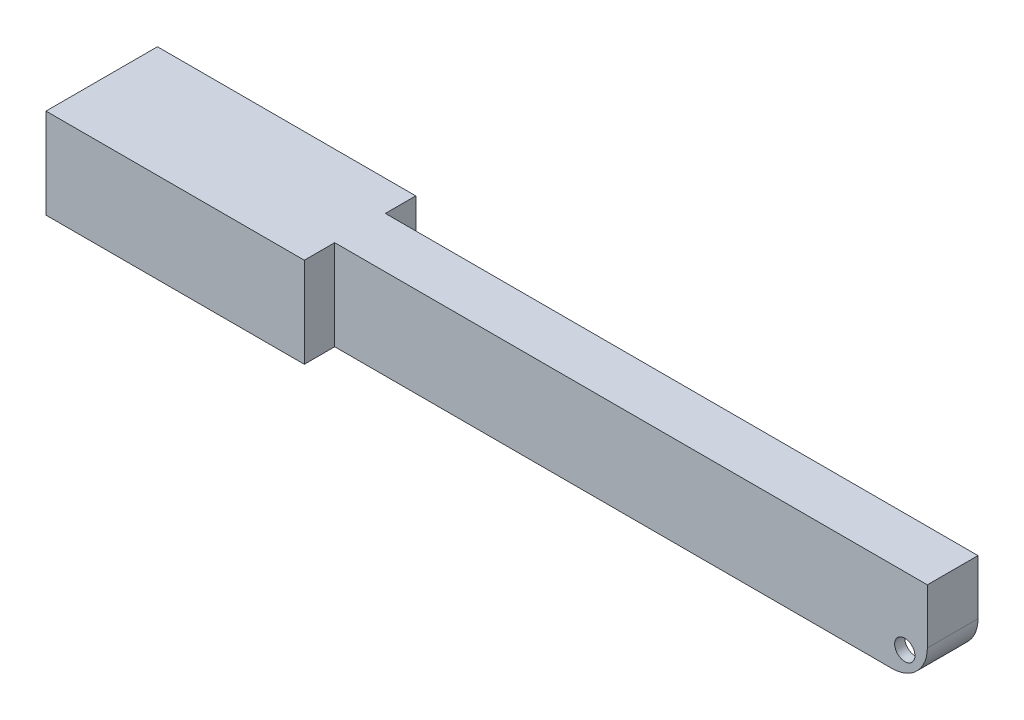
ISO-10303-21;
HEADER;
FILE_DESCRIPTION(('STEP AP214'),'2;1');
FILE_NAME('part.step','',(''),(''),'','','');
FILE_SCHEMA(('AUTOMOTIVE_DESIGN { 1 0 10303 214 1 1 1 1 }'));
ENDSEC;
DATA;
#1=APPLICATION_CONTEXT('core data for automotive mechanical design processes');
#2=APPLICATION_PROTOCOL_DEFINITION('international standard','automotive_design',2000,#1);
#3=PRODUCT_CONTEXT('',#1,'mechanical');
#4=PRODUCT('Part','Part','',(#3));
#5=PRODUCT_RELATED_PRODUCT_CATEGORY('part','',(#4));
#6=PRODUCT_DEFINITION_FORMATION('','',#4);
#7=PRODUCT_DEFINITION_CONTEXT('part definition',#1,'design');
#8=PRODUCT_DEFINITION('design','',#6,#7);
#9=PRODUCT_DEFINITION_SHAPE('','',#8);
#10=(LENGTH_UNIT() NAMED_UNIT(*) SI_UNIT(.MILLI.,.METRE.));
#11=(NAMED_UNIT(*) PLANE_ANGLE_UNIT() SI_UNIT($,.RADIAN.));
#12=(NAMED_UNIT(*) SI_UNIT($,.STERADIAN.) SOLID_ANGLE_UNIT());
#13=UNCERTAINTY_MEASURE_WITH_UNIT(LENGTH_MEASURE(1.E-05),#10,'distance_accuracy_value','');
#14=(GEOMETRIC_REPRESENTATION_CONTEXT(3) GLOBAL_UNCERTAINTY_ASSIGNED_CONTEXT((#13)) GLOBAL_UNIT_ASSIGNED_CONTEXT((#10,
#11,#12)) REPRESENTATION_CONTEXT('',''));
#15=CARTESIAN_POINT('',(0.,0.,0.));
#16=DIRECTION('',(0.,0.,1.));
#17=DIRECTION('',(1.,0.,0.));
#18=AXIS2_PLACEMENT_3D('',#15,#16,#17);
#19=CARTESIAN_POINT('',(-82.,164.984847789123,8.99999999999999));
#20=DIRECTION('',(-1.,0.,0.));
#21=DIRECTION('',(0.,0.,1.));
#22=AXIS2_PLACEMENT_3D('',#19,#20,#21);
#23=PLANE('',#22);
#24=DIRECTION('',(0.,0.,-1.));
#25=VECTOR('',#24,1.);
#26=CARTESIAN_POINT('',(-82.,-14.3,56.0425339453563));
#27=LINE('',#26,#25);
#28=CARTESIAN_POINT('',(-82.,-14.3,8.99999999999999));
#29=VERTEX_POINT('',#28);
#30=CARTESIAN_POINT('',(-82.,-14.3,-9.));
#31=VERTEX_POINT('',#30);
#32=EDGE_CURVE('E252',#29,#31,#27,.T.);
#33=ORIENTED_EDGE('',*,*,#32,.F.);
#34=DIRECTION('',(0.,-1.,0.));
#35=VECTOR('',#34,1.);
#36=CARTESIAN_POINT('',(-82.,164.984847789123,8.99999999999999));
#37=LINE('',#36,#35);
#38=CARTESIAN_POINT('',(-82.,-17.8,8.99999999999999));
#39=VERTEX_POINT('',#38);
#40=EDGE_CURVE('E304',#29,#39,#37,.T.);
#41=ORIENTED_EDGE('',*,*,#40,.T.);
#42=DIRECTION('',(0.,0.,-1.));
#43=VECTOR('',#42,1.);
#44=CARTESIAN_POINT('',(-82.,-17.8,8.99999999999999));
#45=LINE('',#44,#43);
#46=CARTESIAN_POINT('',(-82.,-17.8,-9.));
#47=VERTEX_POINT('',#46);
#48=EDGE_CURVE('E291',#39,#47,#45,.T.);
#49=ORIENTED_EDGE('',*,*,#48,.T.);
#50=DIRECTION('',(0.,-1.,0.));
#51=VECTOR('',#50,1.);
#52=CARTESIAN_POINT('',(-82.,164.984847789123,-9.));
#53=LINE('',#52,#51);
#54=EDGE_CURVE('E301',#31,#47,#53,.T.);
#55=ORIENTED_EDGE('',*,*,#54,.F.);
#56=EDGE_LOOP('',(#33,#41,#49,#55));
#57=FACE_BOUND('',#56,.T.);
#58=ADVANCED_FACE('F47',(#57),#23,.F.);
#59=DIRECTION('',(0.,0.,-1.));
#60=VECTOR('',#59,1.);
#61=CARTESIAN_POINT('',(-82.,-12.3,56.0425339453563));
#62=LINE('',#61,#60);
#63=CARTESIAN_POINT('',(-82.,-12.3,8.99999999999999));
#64=VERTEX_POINT('',#63);
#65=CARTESIAN_POINT('',(-82.,-12.3,-9.));
#66=VERTEX_POINT('',#65);
#67=EDGE_CURVE('E241',#64,#66,#62,.T.);
#68=ORIENTED_EDGE('',*,*,#67,.T.);
#69=CARTESIAN_POINT('',(-82.,-2.,-9.));
#70=VERTEX_POINT('',#69);
#71=EDGE_CURVE('E334',#70,#66,#53,.T.);
#72=ORIENTED_EDGE('',*,*,#71,.F.);
#73=DIRECTION('',(0.,0.,-1.));
#74=VECTOR('',#73,1.);
#75=CARTESIAN_POINT('',(-82.,-2.,8.99999999999999));
#76=LINE('',#75,#74);
#77=CARTESIAN_POINT('',(-82.,-2.,8.99999999999999));
#78=VERTEX_POINT('',#77);
#79=EDGE_CURVE('E276',#78,#70,#76,.T.);
#80=ORIENTED_EDGE('',*,*,#79,.F.);
#81=EDGE_CURVE('E351',#78,#64,#37,.T.);
#82=ORIENTED_EDGE('',*,*,#81,.T.);
#83=EDGE_LOOP('',(#68,#72,#80,#82));
#84=FACE_BOUND('',#83,.T.);
#85=ADVANCED_FACE('F575',(#84),#23,.F.);
#86=CARTESIAN_POINT('',(-82.,164.984847789123,-9.));
#87=DIRECTION('',(0.,0.,-1.));
#88=DIRECTION('',(-1.,0.,0.));
#89=AXIS2_PLACEMENT_3D('',#86,#87,#88);
#90=PLANE('',#89);
#91=DIRECTION('',(1.,0.,0.));
#92=VECTOR('',#91,1.);
#93=CARTESIAN_POINT('',(-82.,-14.3,-9.));
#94=LINE('',#93,#92);
#95=CARTESIAN_POINT('',(-35.,-14.3,-9.));
#96=VERTEX_POINT('',#95);
#97=EDGE_CURVE('E256',#31,#96,#94,.T.);
#98=ORIENTED_EDGE('',*,*,#97,.F.);
#99=ORIENTED_EDGE('',*,*,#54,.T.);
#100=DIRECTION('',(1.,0.,0.));
#101=VECTOR('',#100,1.);
#102=CARTESIAN_POINT('',(-82.,-17.8,-9.));
#103=LINE('',#102,#101);
#104=CARTESIAN_POINT('',(-35.,-17.8,-9.));
#105=VERTEX_POINT('',#104);
#106=EDGE_CURVE('E287',#47,#105,#103,.T.);
#107=ORIENTED_EDGE('',*,*,#106,.T.);
#108=DIRECTION('',(0.,-1.,0.));
#109=VECTOR('',#108,1.);
#110=CARTESIAN_POINT('',(-35.,164.984847789123,-9.));
#111=LINE('',#110,#109);
#112=EDGE_CURVE('E333',#96,#105,#111,.T.);
#113=ORIENTED_EDGE('',*,*,#112,.F.);
#114=EDGE_LOOP('',(#98,#99,#107,#113));
#115=FACE_BOUND('',#114,.T.);
#116=ADVANCED_FACE('F536',(#115),#90,.F.);
#117=DIRECTION('',(-1.,0.,0.));
#118=VECTOR('',#117,1.);
#119=CARTESIAN_POINT('',(-82.,-12.3,-9.));
#120=LINE('',#119,#118);
#121=CARTESIAN_POINT('',(-35.,-12.3,-9.));
#122=VERTEX_POINT('',#121);
#123=EDGE_CURVE('E234',#122,#66,#120,.T.);
#124=ORIENTED_EDGE('',*,*,#123,.F.);
#125=CARTESIAN_POINT('',(-35.,-2.,-9.));
#126=VERTEX_POINT('',#125);
#127=EDGE_CURVE('E329',#126,#122,#111,.T.);
#128=ORIENTED_EDGE('',*,*,#127,.F.);
#129=DIRECTION('',(1.,0.,0.));
#130=VECTOR('',#129,1.);
#131=CARTESIAN_POINT('',(-82.,-2.,-9.));
#132=LINE('',#131,#130);
#133=EDGE_CURVE('E330',#70,#126,#132,.T.);
#134=ORIENTED_EDGE('',*,*,#133,.F.);
#135=ORIENTED_EDGE('',*,*,#71,.T.);
#136=EDGE_LOOP('',(#124,#128,#134,#135));
#137=FACE_BOUND('',#136,.T.);
#138=ADVANCED_FACE('F572',(#137),#90,.F.);
#139=CARTESIAN_POINT('',(-35.,164.984847789123,-9.));
#140=DIRECTION('',(1.,0.,0.));
#141=DIRECTION('',(0.,0.,-1.));
#142=AXIS2_PLACEMENT_3D('',#139,#140,#141);
#143=PLANE('',#142);
#144=DIRECTION('',(0.,0.,-1.));
#145=VECTOR('',#144,1.);
#146=CARTESIAN_POINT('',(-35.,-14.3,56.0425339453563));
#147=LINE('',#146,#145);
#148=CARTESIAN_POINT('',(-35.,-14.3,-3.));
#149=VERTEX_POINT('',#148);
#150=EDGE_CURVE('E260',#149,#96,#147,.T.);
#151=ORIENTED_EDGE('',*,*,#150,.T.);
#152=ORIENTED_EDGE('',*,*,#112,.T.);
#153=DIRECTION('',(0.,0.,1.));
#154=VECTOR('',#153,1.);
#155=CARTESIAN_POINT('',(-35.,-17.8,-9.));
#156=LINE('',#155,#154);
#157=CARTESIAN_POINT('',(-35.,-17.8,-3.));
#158=VERTEX_POINT('',#157);
#159=EDGE_CURVE('E283',#105,#158,#156,.T.);
#160=ORIENTED_EDGE('',*,*,#159,.T.);
#161=DIRECTION('',(0.,-1.,0.));
#162=VECTOR('',#161,1.);
#163=CARTESIAN_POINT('',(-35.,164.984847789123,-3.));
#164=LINE('',#163,#162);
#165=EDGE_CURVE('E328',#149,#158,#164,.T.);
#166=ORIENTED_EDGE('',*,*,#165,.F.);
#167=EDGE_LOOP('',(#151,#152,#160,#166));
#168=FACE_BOUND('',#167,.T.);
#169=ADVANCED_FACE('F531',(#168),#143,.F.);
#170=DIRECTION('',(0.,0.,-1.));
#171=VECTOR('',#170,1.);
#172=CARTESIAN_POINT('',(-35.,-12.3,56.0425339453563));
#173=LINE('',#172,#171);
#174=CARTESIAN_POINT('',(-35.,-12.3,-3.));
#175=VERTEX_POINT('',#174);
#176=EDGE_CURVE('E237',#175,#122,#173,.T.);
#177=ORIENTED_EDGE('',*,*,#176,.F.);
#178=CARTESIAN_POINT('',(-35.,-2.,-3.));
#179=VERTEX_POINT('',#178);
#180=EDGE_CURVE('E323',#179,#175,#164,.T.);
#181=ORIENTED_EDGE('',*,*,#180,.F.);
#182=DIRECTION('',(0.,0.,1.));
#183=VECTOR('',#182,1.);
#184=CARTESIAN_POINT('',(-35.,-2.,-9.));
#185=LINE('',#184,#183);
#186=EDGE_CURVE('E324',#126,#179,#185,.T.);
#187=ORIENTED_EDGE('',*,*,#186,.F.);
#188=ORIENTED_EDGE('',*,*,#127,.T.);
#189=EDGE_LOOP('',(#177,#181,#187,#188));
#190=FACE_BOUND('',#189,.T.);
#191=ADVANCED_FACE('F567',(#190),#143,.F.);
#192=CARTESIAN_POINT('',(-35.,164.984847789123,8.99999999999999));
#193=DIRECTION('',(1.,0.,0.));
#194=DIRECTION('',(0.,0.,-1.));
#195=AXIS2_PLACEMENT_3D('',#192,#193,#194);
#196=PLANE('',#195);
#197=CARTESIAN_POINT('',(-35.,-14.3,8.99999999999999));
#198=VERTEX_POINT('',#197);
#199=CARTESIAN_POINT('',(-35.,-14.3,3.));
#200=VERTEX_POINT('',#199);
#201=EDGE_CURVE('E257',#198,#200,#147,.T.);
#202=ORIENTED_EDGE('',*,*,#201,.T.);
#203=DIRECTION('',(0.,-1.,0.));
#204=VECTOR('',#203,1.);
#205=CARTESIAN_POINT('',(-35.,164.984847789123,3.));
#206=LINE('',#205,#204);
#207=CARTESIAN_POINT('',(-35.,-17.8,3.));
#208=VERTEX_POINT('',#207);
#209=EDGE_CURVE('E312',#200,#208,#206,.T.);
#210=ORIENTED_EDGE('',*,*,#209,.T.);
#211=DIRECTION('',(0.,0.,1.));
#212=VECTOR('',#211,1.);
#213=CARTESIAN_POINT('',(-35.,-17.8,8.99999999999999));
#214=LINE('',#213,#212);
#215=CARTESIAN_POINT('',(-35.,-17.8,8.99999999999999));
#216=VERTEX_POINT('',#215);
#217=EDGE_CURVE('E272',#208,#216,#214,.T.);
#218=ORIENTED_EDGE('',*,*,#217,.T.);
#219=DIRECTION('',(0.,-1.,0.));
#220=VECTOR('',#219,1.);
#221=CARTESIAN_POINT('',(-35.,164.984847789123,8.99999999999999));
#222=LINE('',#221,#220);
#223=EDGE_CURVE('E222',#198,#216,#222,.T.);
#224=ORIENTED_EDGE('',*,*,#223,.F.);
#225=EDGE_LOOP('',(#202,#210,#218,#224));
#226=FACE_BOUND('',#225,.T.);
#227=ADVANCED_FACE('F550',(#226),#196,.F.);
#228=CARTESIAN_POINT('',(-35.,-12.3,8.99999999999999));
#229=VERTEX_POINT('',#228);
#230=CARTESIAN_POINT('',(-35.,-12.3,3.));
#231=VERTEX_POINT('',#230);
#232=EDGE_CURVE('E226',#229,#231,#173,.T.);
#233=ORIENTED_EDGE('',*,*,#232,.F.);
#234=CARTESIAN_POINT('',(-35.,-2.,8.99999999999999));
#235=VERTEX_POINT('',#234);
#236=EDGE_CURVE('E210',#235,#229,#222,.T.);
#237=ORIENTED_EDGE('',*,*,#236,.F.);
#238=DIRECTION('',(0.,0.,1.));
#239=VECTOR('',#238,1.);
#240=CARTESIAN_POINT('',(-35.,-2.,8.99999999999999));
#241=LINE('',#240,#239);
#242=CARTESIAN_POINT('',(-35.,-2.,3.));
#243=VERTEX_POINT('',#242);
#244=EDGE_CURVE('E305',#243,#235,#241,.T.);
#245=ORIENTED_EDGE('',*,*,#244,.F.);
#246=EDGE_CURVE('E229',#243,#231,#206,.T.);
#247=ORIENTED_EDGE('',*,*,#246,.T.);
#248=EDGE_LOOP('',(#233,#237,#245,#247));
#249=FACE_BOUND('',#248,.T.);
#250=ADVANCED_FACE('F227',(#249),#196,.F.);
#251=CARTESIAN_POINT('',(-35.,164.984847789123,8.99999999999999));
#252=DIRECTION('',(0.,0.,1.));
#253=DIRECTION('',(1.,0.,0.));
#254=AXIS2_PLACEMENT_3D('',#251,#252,#253);
#255=PLANE('',#254);
#256=DIRECTION('',(1.,0.,0.));
#257=VECTOR('',#256,1.);
#258=CARTESIAN_POINT('',(-82.,-14.3,8.99999999999999));
#259=LINE('',#258,#257);
#260=EDGE_CURVE('E243',#29,#198,#259,.T.);
#261=ORIENTED_EDGE('',*,*,#260,.T.);
#262=ORIENTED_EDGE('',*,*,#223,.T.);
#263=DIRECTION('',(-1.,0.,0.));
#264=VECTOR('',#263,1.);
#265=CARTESIAN_POINT('',(-35.,-17.8,8.99999999999999));
#266=LINE('',#265,#264);
#267=EDGE_CURVE('E271',#216,#39,#266,.T.);
#268=ORIENTED_EDGE('',*,*,#267,.T.);
#269=ORIENTED_EDGE('',*,*,#40,.F.);
#270=EDGE_LOOP('',(#261,#262,#268,#269));
#271=FACE_BOUND('',#270,.T.);
#272=ADVANCED_FACE('F545',(#271),#255,.F.);
#273=DIRECTION('',(-1.,0.,0.));
#274=VECTOR('',#273,1.);
#275=CARTESIAN_POINT('',(-82.,-12.3,8.99999999999999));
#276=LINE('',#275,#274);
#277=EDGE_CURVE('E215',#229,#64,#276,.T.);
#278=ORIENTED_EDGE('',*,*,#277,.T.);
#279=ORIENTED_EDGE('',*,*,#81,.F.);
#280=DIRECTION('',(-1.,0.,0.));
#281=VECTOR('',#280,1.);
#282=CARTESIAN_POINT('',(-35.,-2.,8.99999999999999));
#283=LINE('',#282,#281);
#284=EDGE_CURVE('E218',#235,#78,#283,.T.);
#285=ORIENTED_EDGE('',*,*,#284,.F.);
#286=ORIENTED_EDGE('',*,*,#236,.T.);
#287=EDGE_LOOP('',(#278,#279,#285,#286));
#288=FACE_BOUND('',#287,.T.);
#289=ADVANCED_FACE('F212',(#288),#255,.F.);
#290=CARTESIAN_POINT('',(79.55,-13.35,-16.6568542494924));
#291=DIRECTION('',(0.,0.,1.));
#292=DIRECTION('',(1.,0.,0.));
#293=AXIS2_PLACEMENT_3D('',#290,#291,#292);
#294=CYLINDRICAL_SURFACE('',#293,2.);
#295=CARTESIAN_POINT('',(79.55,-13.35,-3.));
#296=DIRECTION('',(0.,0.,-1.));
#297=DIRECTION('',(-1.,0.,0.));
#298=AXIS2_PLACEMENT_3D('',#295,#296,#297);
#299=CIRCLE('',#298,2.);
#300=CARTESIAN_POINT('',(77.55,-13.35,-3.));
#301=VERTEX_POINT('',#300);
#302=EDGE_CURVE('E385',#301,#301,#299,.F.);
#303=ORIENTED_EDGE('',*,*,#302,.T.);
#304=EDGE_LOOP('',(#303));
#305=FACE_BOUND('',#304,.T.);
#306=CARTESIAN_POINT('',(79.55,-13.35,-5.));
#307=DIRECTION('',(0.,0.,1.));
#308=DIRECTION('',(1.,0.,0.));
#309=AXIS2_PLACEMENT_3D('',#306,#307,#308);
#310=CIRCLE('',#309,2.);
#311=CARTESIAN_POINT('',(81.55,-13.35,-5.));
#312=VERTEX_POINT('',#311);
#313=EDGE_CURVE('E422',#312,#312,#310,.F.);
#314=ORIENTED_EDGE('',*,*,#313,.T.);
#315=EDGE_LOOP('',(#314));
#316=FACE_BOUND('',#315,.T.);
#317=ADVANCED_FACE('F608',(#305,#316),#294,.F.);
#318=CARTESIAN_POINT('',(-84.,-17.8,11.));
#319=DIRECTION('',(0.,0.,1.));
#320=DIRECTION('',(1.,0.,0.));
#321=AXIS2_PLACEMENT_3D('',#318,#319,#320);
#322=PLANE('',#321);
#323=DIRECTION('',(0.,1.,0.));
#324=VECTOR('',#323,1.);
#325=CARTESIAN_POINT('',(-33.,-134.9537451386,11.));
#326=LINE('',#325,#324);
#327=CARTESIAN_POINT('',(-33.,-17.8,11.));
#328=VERTEX_POINT('',#327);
#329=CARTESIAN_POINT('',(-33.,0.,11.));
#330=VERTEX_POINT('',#329);
#331=EDGE_CURVE('E393',#328,#330,#326,.T.);
#332=ORIENTED_EDGE('',*,*,#331,.T.);
#333=DIRECTION('',(1.,0.,0.));
#334=VECTOR('',#333,1.);
#335=CARTESIAN_POINT('',(-84.,0.,11.));
#336=LINE('',#335,#334);
#337=CARTESIAN_POINT('',(-84.,0.,11.));
#338=VERTEX_POINT('',#337);
#339=EDGE_CURVE('E417',#338,#330,#336,.T.);
#340=ORIENTED_EDGE('',*,*,#339,.F.);
#341=DIRECTION('',(0.,1.,0.));
#342=VECTOR('',#341,1.);
#343=CARTESIAN_POINT('',(-84.,-17.8,11.));
#344=LINE('',#343,#342);
#345=CARTESIAN_POINT('',(-84.,-17.8,11.));
#346=VERTEX_POINT('',#345);
#347=EDGE_CURVE('E432',#346,#338,#344,.T.);
#348=ORIENTED_EDGE('',*,*,#347,.F.);
#349=DIRECTION('',(1.,0.,0.));
#350=VECTOR('',#349,1.);
#351=CARTESIAN_POINT('',(-84.,-17.8,11.));
#352=LINE('',#351,#350);
#353=EDGE_CURVE('E404',#346,#328,#352,.T.);
#354=ORIENTED_EDGE('',*,*,#353,.T.);
#355=EDGE_LOOP('',(#332,#340,#348,#354));
#356=FACE_BOUND('',#355,.T.);
#357=ADVANCED_FACE('F503',(#356),#322,.T.);
#358=CARTESIAN_POINT('',(-84.,-17.8,11.));
#359=DIRECTION('',(1.,0.,0.));
#360=DIRECTION('',(0.,0.,-1.));
#361=AXIS2_PLACEMENT_3D('',#358,#359,#360);
#362=PLANE('',#361);
#363=DIRECTION('',(0.,0.,-1.));
#364=VECTOR('',#363,1.);
#365=CARTESIAN_POINT('',(-84.,0.,11.));
#366=LINE('',#365,#364);
#367=CARTESIAN_POINT('',(-84.,0.,-11.));
#368=VERTEX_POINT('',#367);
#369=EDGE_CURVE('E409',#338,#368,#366,.T.);
#370=ORIENTED_EDGE('',*,*,#369,.T.);
#371=DIRECTION('',(0.,1.,0.));
#372=VECTOR('',#371,1.);
#373=CARTESIAN_POINT('',(-84.,-17.8,-11.));
#374=LINE('',#373,#372);
#375=CARTESIAN_POINT('',(-84.,-17.8,-11.));
#376=VERTEX_POINT('',#375);
#377=EDGE_CURVE('E416',#376,#368,#374,.T.);
#378=ORIENTED_EDGE('',*,*,#377,.F.);
#379=DIRECTION('',(0.,0.,-1.));
#380=VECTOR('',#379,1.);
#381=CARTESIAN_POINT('',(-84.,-17.8,11.));
#382=LINE('',#381,#380);
#383=EDGE_CURVE('E413',#346,#376,#382,.T.);
#384=ORIENTED_EDGE('',*,*,#383,.F.);
#385=ORIENTED_EDGE('',*,*,#347,.T.);
#386=EDGE_LOOP('',(#370,#378,#384,#385));
#387=FACE_BOUND('',#386,.T.);
#388=ADVANCED_FACE('F509',(#387),#362,.F.);
#389=CARTESIAN_POINT('',(-84.,-17.8,-11.));
#390=DIRECTION('',(0.,0.,1.));
#391=DIRECTION('',(1.,0.,0.));
#392=AXIS2_PLACEMENT_3D('',#389,#390,#391);
#393=PLANE('',#392);
#394=DIRECTION('',(1.,0.,0.));
#395=VECTOR('',#394,1.);
#396=CARTESIAN_POINT('',(-84.,0.,-11.));
#397=LINE('',#396,#395);
#398=CARTESIAN_POINT('',(-33.,0.,-11.));
#399=VERTEX_POINT('',#398);
#400=EDGE_CURVE('E426',#368,#399,#397,.T.);
#401=ORIENTED_EDGE('',*,*,#400,.T.);
#402=DIRECTION('',(0.,1.,0.));
#403=VECTOR('',#402,1.);
#404=CARTESIAN_POINT('',(-33.,-134.9537451386,-11.));
#405=LINE('',#404,#403);
#406=CARTESIAN_POINT('',(-33.,-17.8,-11.));
#407=VERTEX_POINT('',#406);
#408=EDGE_CURVE('E372',#407,#399,#405,.T.);
#409=ORIENTED_EDGE('',*,*,#408,.F.);
#410=DIRECTION('',(1.,0.,0.));
#411=VECTOR('',#410,1.);
#412=CARTESIAN_POINT('',(-84.,-17.8,-11.));
#413=LINE('',#412,#411);
#414=EDGE_CURVE('E408',#376,#407,#413,.T.);
#415=ORIENTED_EDGE('',*,*,#414,.F.);
#416=ORIENTED_EDGE('',*,*,#377,.T.);
#417=EDGE_LOOP('',(#401,#409,#415,#416));
#418=FACE_BOUND('',#417,.T.);
#419=ADVANCED_FACE('F514',(#418),#393,.F.);
#420=CARTESIAN_POINT('',(84.,-17.8,11.));
#421=DIRECTION('',(1.,0.,0.));
#422=DIRECTION('',(0.,0.,-1.));
#423=AXIS2_PLACEMENT_3D('',#420,#421,#422);
#424=PLANE('',#423);
#425=DIRECTION('',(0.,1.,0.));
#426=VECTOR('',#425,1.);
#427=CARTESIAN_POINT('',(84.,-134.9537451386,5.));
#428=LINE('',#427,#426);
#429=CARTESIAN_POINT('',(84.,-10.8,5.));
#430=VERTEX_POINT('',#429);
#431=CARTESIAN_POINT('',(84.,0.,5.));
#432=VERTEX_POINT('',#431);
#433=EDGE_CURVE('E386',#430,#432,#428,.T.);
#434=ORIENTED_EDGE('',*,*,#433,.F.);
#435=DIRECTION('',(0.,0.,-1.));
#436=VECTOR('',#435,1.);
#437=CARTESIAN_POINT('',(84.,-10.8,-5.));
#438=LINE('',#437,#436);
#439=CARTESIAN_POINT('',(84.,-10.8,-5.));
#440=VERTEX_POINT('',#439);
#441=EDGE_CURVE('E435',#430,#440,#438,.T.);
#442=ORIENTED_EDGE('',*,*,#441,.T.);
#443=DIRECTION('',(0.,1.,0.));
#444=VECTOR('',#443,1.);
#445=CARTESIAN_POINT('',(84.,-134.9537451386,-5.));
#446=LINE('',#445,#444);
#447=CARTESIAN_POINT('',(84.,0.,-5.));
#448=VERTEX_POINT('',#447);
#449=EDGE_CURVE('E359',#440,#448,#446,.T.);
#450=ORIENTED_EDGE('',*,*,#449,.T.);
#451=DIRECTION('',(0.,0.,-1.));
#452=VECTOR('',#451,1.);
#453=CARTESIAN_POINT('',(84.,0.,11.));
#454=LINE('',#453,#452);
#455=EDGE_CURVE('E421',#432,#448,#454,.T.);
#456=ORIENTED_EDGE('',*,*,#455,.F.);
#457=EDGE_LOOP('',(#434,#442,#450,#456));
#458=FACE_BOUND('',#457,.T.);
#459=ADVANCED_FACE('F492',(#458),#424,.T.);
#460=CARTESIAN_POINT('',(0.,-17.8,0.));
#461=DIRECTION('',(0.,1.,0.));
#462=DIRECTION('',(0.,0.,1.));
#463=AXIS2_PLACEMENT_3D('',#460,#461,#462);
#464=PLANE('',#463);
#465=DIRECTION('',(-1.,0.,0.));
#466=VECTOR('',#465,1.);
#467=CARTESIAN_POINT('',(-33.,-17.8,-5.));
#468=LINE('',#467,#466);
#469=CARTESIAN_POINT('',(77.,-17.8,-5.));
#470=VERTEX_POINT('',#469);
#471=CARTESIAN_POINT('',(-33.,-17.8,-5.));
#472=VERTEX_POINT('',#471);
#473=EDGE_CURVE('E358',#470,#472,#468,.T.);
#474=ORIENTED_EDGE('',*,*,#473,.F.);
#475=DIRECTION('',(0.,0.,-1.));
#476=VECTOR('',#475,1.);
#477=CARTESIAN_POINT('',(77.,-17.8,5.));
#478=LINE('',#477,#476);
#479=CARTESIAN_POINT('',(77.,-17.8,-3.));
#480=VERTEX_POINT('',#479);
#481=EDGE_CURVE('E460',#470,#480,#478,.F.);
#482=ORIENTED_EDGE('',*,*,#481,.T.);
#483=DIRECTION('',(1.,0.,0.));
#484=VECTOR('',#483,1.);
#485=CARTESIAN_POINT('',(-35.,-17.8,-3.));
#486=LINE('',#485,#484);
#487=EDGE_CURVE('E280',#158,#480,#486,.T.);
#488=ORIENTED_EDGE('',*,*,#487,.F.);
#489=ORIENTED_EDGE('',*,*,#159,.F.);
#490=ORIENTED_EDGE('',*,*,#106,.F.);
#491=ORIENTED_EDGE('',*,*,#48,.F.);
#492=ORIENTED_EDGE('',*,*,#267,.F.);
#493=ORIENTED_EDGE('',*,*,#217,.F.);
#494=DIRECTION('',(-1.,0.,0.));
#495=VECTOR('',#494,1.);
#496=CARTESIAN_POINT('',(-35.,-17.8,3.));
#497=LINE('',#496,#495);
#498=CARTESIAN_POINT('',(77.,-17.8,3.));
#499=VERTEX_POINT('',#498);
#500=EDGE_CURVE('E277',#499,#208,#497,.T.);
#501=ORIENTED_EDGE('',*,*,#500,.F.);
#502=DIRECTION('',(0.,0.,-1.));
#503=VECTOR('',#502,1.);
#504=CARTESIAN_POINT('',(77.,-17.8,5.));
#505=LINE('',#504,#503);
#506=CARTESIAN_POINT('',(77.,-17.8,5.));
#507=VERTEX_POINT('',#506);
#508=EDGE_CURVE('E457',#499,#507,#505,.F.);
#509=ORIENTED_EDGE('',*,*,#508,.T.);
#510=DIRECTION('',(1.,0.,0.));
#511=VECTOR('',#510,1.);
#512=CARTESIAN_POINT('',(-33.,-17.8,5.));
#513=LINE('',#512,#511);
#514=CARTESIAN_POINT('',(-33.,-17.8,5.));
#515=VERTEX_POINT('',#514);
#516=EDGE_CURVE('E380',#515,#507,#513,.T.);
#517=ORIENTED_EDGE('',*,*,#516,.F.);
#518=DIRECTION('',(0.,0.,-1.));
#519=VECTOR('',#518,1.);
#520=CARTESIAN_POINT('',(-33.,-17.8,11.));
#521=LINE('',#520,#519);
#522=EDGE_CURVE('E384',#328,#515,#521,.T.);
#523=ORIENTED_EDGE('',*,*,#522,.F.);
#524=ORIENTED_EDGE('',*,*,#353,.F.);
#525=ORIENTED_EDGE('',*,*,#383,.T.);
#526=ORIENTED_EDGE('',*,*,#414,.T.);
#527=DIRECTION('',(0.,0.,-1.));
#528=VECTOR('',#527,1.);
#529=CARTESIAN_POINT('',(-33.,-17.8,-11.));
#530=LINE('',#529,#528);
#531=EDGE_CURVE('E355',#472,#407,#530,.T.);
#532=ORIENTED_EDGE('',*,*,#531,.F.);
#533=EDGE_LOOP('',(#474,#482,#488,#489,#490,#491,#492,#493,#501,#509,#517,#523,#524,#525,#526,#532));
#534=FACE_BOUND('',#533,.T.);
#535=ADVANCED_FACE('F479',(#534),#464,.F.);
#536=CARTESIAN_POINT('',(0.,0.,0.));
#537=DIRECTION('',(0.,1.,0.));
#538=DIRECTION('',(0.,0.,1.));
#539=AXIS2_PLACEMENT_3D('',#536,#537,#538);
#540=PLANE('',#539);
#541=DIRECTION('',(1.,0.,0.));
#542=VECTOR('',#541,1.);
#543=CARTESIAN_POINT('',(-33.,0.,-5.));
#544=LINE('',#543,#542);
#545=CARTESIAN_POINT('',(-33.,0.,-5.));
#546=VERTEX_POINT('',#545);
#547=EDGE_CURVE('E367',#546,#448,#544,.T.);
#548=ORIENTED_EDGE('',*,*,#547,.F.);
#549=DIRECTION('',(0.,0.,1.));
#550=VECTOR('',#549,1.);
#551=CARTESIAN_POINT('',(-33.,0.,-11.));
#552=LINE('',#551,#550);
#553=EDGE_CURVE('E363',#399,#546,#552,.T.);
#554=ORIENTED_EDGE('',*,*,#553,.F.);
#555=ORIENTED_EDGE('',*,*,#400,.F.);
#556=ORIENTED_EDGE('',*,*,#369,.F.);
#557=ORIENTED_EDGE('',*,*,#339,.T.);
#558=DIRECTION('',(0.,0.,1.));
#559=VECTOR('',#558,1.);
#560=CARTESIAN_POINT('',(-33.,0.,11.));
#561=LINE('',#560,#559);
#562=CARTESIAN_POINT('',(-33.,0.,5.));
#563=VERTEX_POINT('',#562);
#564=EDGE_CURVE('E389',#563,#330,#561,.T.);
#565=ORIENTED_EDGE('',*,*,#564,.F.);
#566=DIRECTION('',(-1.,0.,0.));
#567=VECTOR('',#566,1.);
#568=CARTESIAN_POINT('',(-33.,0.,5.));
#569=LINE('',#568,#567);
#570=EDGE_CURVE('E368',#432,#563,#569,.T.);
#571=ORIENTED_EDGE('',*,*,#570,.F.);
#572=ORIENTED_EDGE('',*,*,#455,.T.);
#573=EDGE_LOOP('',(#548,#554,#555,#556,#557,#565,#571,#572));
#574=FACE_BOUND('',#573,.T.);
#575=ADVANCED_FACE('F496',(#574),#540,.T.);
#576=CARTESIAN_POINT('',(-33.,-134.9537451386,5.));
#577=DIRECTION('',(0.,0.,-1.));
#578=DIRECTION('',(-1.,0.,0.));
#579=AXIS2_PLACEMENT_3D('',#576,#577,#578);
#580=PLANE('',#579);
#581=ORIENTED_EDGE('',*,*,#516,.T.);
#582=CARTESIAN_POINT('',(77.,-10.8,5.));
#583=DIRECTION('',(0.,0.,-1.));
#584=DIRECTION('',(-1.,0.,0.));
#585=AXIS2_PLACEMENT_3D('',#582,#583,#584);
#586=CIRCLE('',#585,7.);
#587=EDGE_CURVE('E12',#507,#430,#586,.F.);
#588=ORIENTED_EDGE('',*,*,#587,.T.);
#589=ORIENTED_EDGE('',*,*,#433,.T.);
#590=ORIENTED_EDGE('',*,*,#570,.T.);
#591=DIRECTION('',(0.,1.,0.));
#592=VECTOR('',#591,1.);
#593=CARTESIAN_POINT('',(-33.,-134.9537451386,5.));
#594=LINE('',#593,#592);
#595=EDGE_CURVE('E390',#515,#563,#594,.T.);
#596=ORIENTED_EDGE('',*,*,#595,.F.);
#597=EDGE_LOOP('',(#581,#588,#589,#590,#596));
#598=FACE_BOUND('',#597,.T.);
#599=CARTESIAN_POINT('',(79.55,-13.35,5.));
#600=DIRECTION('',(0.,0.,-1.));
#601=DIRECTION('',(-1.,0.,0.));
#602=AXIS2_PLACEMENT_3D('',#599,#600,#601);
#603=CIRCLE('',#602,2.);
#604=CARTESIAN_POINT('',(77.55,-13.35,5.));
#605=VERTEX_POINT('',#604);
#606=EDGE_CURVE('E362',#605,#605,#603,.F.);
#607=ORIENTED_EDGE('',*,*,#606,.F.);
#608=EDGE_LOOP('',(#607));
#609=FACE_BOUND('',#608,.T.);
#610=ADVANCED_FACE('F486',(#598,#609),#580,.F.);
#611=CARTESIAN_POINT('',(-33.,-134.9537451386,11.));
#612=DIRECTION('',(-1.,0.,0.));
#613=DIRECTION('',(0.,0.,1.));
#614=AXIS2_PLACEMENT_3D('',#611,#612,#613);
#615=PLANE('',#614);
#616=ORIENTED_EDGE('',*,*,#522,.T.);
#617=ORIENTED_EDGE('',*,*,#595,.T.);
#618=ORIENTED_EDGE('',*,*,#564,.T.);
#619=ORIENTED_EDGE('',*,*,#331,.F.);
#620=EDGE_LOOP('',(#616,#617,#618,#619));
#621=FACE_BOUND('',#620,.T.);
#622=ADVANCED_FACE('F597',(#621),#615,.F.);
#623=CARTESIAN_POINT('',(-33.,-134.9537451386,-5.));
#624=DIRECTION('',(0.,0.,1.));
#625=DIRECTION('',(1.,0.,0.));
#626=AXIS2_PLACEMENT_3D('',#623,#624,#625);
#627=PLANE('',#626);
#628=ORIENTED_EDGE('',*,*,#449,.F.);
#629=CARTESIAN_POINT('',(77.,-10.8,-5.));
#630=DIRECTION('',(0.,0.,1.));
#631=DIRECTION('',(1.,0.,0.));
#632=AXIS2_PLACEMENT_3D('',#629,#630,#631);
#633=CIRCLE('',#632,7.);
#634=EDGE_CURVE('E454',#440,#470,#633,.F.);
#635=ORIENTED_EDGE('',*,*,#634,.T.);
#636=ORIENTED_EDGE('',*,*,#473,.T.);
#637=DIRECTION('',(0.,1.,0.));
#638=VECTOR('',#637,1.);
#639=CARTESIAN_POINT('',(-33.,-134.9537451386,-5.));
#640=LINE('',#639,#638);
#641=EDGE_CURVE('E375',#472,#546,#640,.T.);
#642=ORIENTED_EDGE('',*,*,#641,.T.);
#643=ORIENTED_EDGE('',*,*,#547,.T.);
#644=EDGE_LOOP('',(#628,#635,#636,#642,#643));
#645=FACE_BOUND('',#644,.T.);
#646=ORIENTED_EDGE('',*,*,#313,.F.);
#647=EDGE_LOOP('',(#646));
#648=FACE_BOUND('',#647,.T.);
#649=ADVANCED_FACE('F520',(#645,#648),#627,.F.);
#650=CARTESIAN_POINT('',(-33.,-134.9537451386,-11.));
#651=DIRECTION('',(-1.,0.,0.));
#652=DIRECTION('',(0.,0.,1.));
#653=AXIS2_PLACEMENT_3D('',#650,#651,#652);
#654=PLANE('',#653);
#655=ORIENTED_EDGE('',*,*,#531,.T.);
#656=ORIENTED_EDGE('',*,*,#408,.T.);
#657=ORIENTED_EDGE('',*,*,#553,.T.);
#658=ORIENTED_EDGE('',*,*,#641,.F.);
#659=EDGE_LOOP('',(#655,#656,#657,#658));
#660=FACE_BOUND('',#659,.T.);
#661=ADVANCED_FACE('F517',(#660),#654,.F.);
#662=CARTESIAN_POINT('',(79.55,-13.35,3.));
#663=DIRECTION('',(0.,0.,1.));
#664=DIRECTION('',(1.,0.,0.));
#665=AXIS2_PLACEMENT_3D('',#662,#663,#664);
#666=CIRCLE('',#665,2.);
#667=CARTESIAN_POINT('',(81.55,-13.35,3.));
#668=VERTEX_POINT('',#667);
#669=EDGE_CURVE('E354',#668,#668,#666,.F.);
#670=ORIENTED_EDGE('',*,*,#669,.T.);
#671=EDGE_LOOP('',(#670));
#672=FACE_BOUND('',#671,.T.);
#673=ORIENTED_EDGE('',*,*,#606,.T.);
#674=EDGE_LOOP('',(#673));
#675=FACE_BOUND('',#674,.T.);
#676=ADVANCED_FACE('F600',(#672,#675),#294,.F.);
#677=CARTESIAN_POINT('',(-35.,164.984847789123,-3.));
#678=DIRECTION('',(0.,0.,-1.));
#679=DIRECTION('',(-1.,0.,0.));
#680=AXIS2_PLACEMENT_3D('',#677,#678,#679);
#681=PLANE('',#680);
#682=ORIENTED_EDGE('',*,*,#487,.T.);
#683=CARTESIAN_POINT('',(77.,-10.8,-3.));
#684=DIRECTION('',(0.,0.,-1.));
#685=DIRECTION('',(-1.,0.,0.));
#686=AXIS2_PLACEMENT_3D('',#683,#684,#685);
#687=CIRCLE('',#686,7.);
#688=CARTESIAN_POINT('',(82.,-15.6989794855663,-3.));
#689=VERTEX_POINT('',#688);
#690=EDGE_CURVE('E71',#480,#689,#687,.F.);
#691=ORIENTED_EDGE('',*,*,#690,.T.);
#692=DIRECTION('',(0.,-1.,0.));
#693=VECTOR('',#692,1.);
#694=CARTESIAN_POINT('',(82.,164.984847789123,-3.));
#695=LINE('',#694,#693);
#696=CARTESIAN_POINT('',(82.,-2.,-3.));
#697=VERTEX_POINT('',#696);
#698=EDGE_CURVE('E318',#697,#689,#695,.T.);
#699=ORIENTED_EDGE('',*,*,#698,.F.);
#700=DIRECTION('',(1.,0.,0.));
#701=VECTOR('',#700,1.);
#702=CARTESIAN_POINT('',(-35.,-2.,-3.));
#703=LINE('',#702,#701);
#704=EDGE_CURVE('E319',#179,#697,#703,.T.);
#705=ORIENTED_EDGE('',*,*,#704,.F.);
#706=ORIENTED_EDGE('',*,*,#180,.T.);
#707=DIRECTION('',(0.,1.,0.));
#708=VECTOR('',#707,1.);
#709=CARTESIAN_POINT('',(-35.,164.984847789123,-3.));
#710=LINE('',#709,#708);
#711=EDGE_CURVE('E267',#149,#175,#710,.T.);
#712=ORIENTED_EDGE('',*,*,#711,.F.);
#713=ORIENTED_EDGE('',*,*,#165,.T.);
#714=EDGE_LOOP('',(#682,#691,#699,#705,#706,#712,#713));
#715=FACE_BOUND('',#714,.T.);
#716=ORIENTED_EDGE('',*,*,#302,.F.);
#717=EDGE_LOOP('',(#716));
#718=FACE_BOUND('',#717,.T.);
#719=ADVANCED_FACE('F525',(#715,#718),#681,.F.);
#720=CARTESIAN_POINT('',(-35.,164.984847789123,3.));
#721=DIRECTION('',(0.,0.,1.));
#722=DIRECTION('',(1.,0.,0.));
#723=AXIS2_PLACEMENT_3D('',#720,#721,#722);
#724=PLANE('',#723);
#725=DIRECTION('',(0.,-1.,0.));
#726=VECTOR('',#725,1.);
#727=CARTESIAN_POINT('',(82.,164.984847789123,3.));
#728=LINE('',#727,#726);
#729=CARTESIAN_POINT('',(82.,-2.,3.));
#730=VERTEX_POINT('',#729);
#731=CARTESIAN_POINT('',(82.,-15.6989794855664,3.));
#732=VERTEX_POINT('',#731);
#733=EDGE_CURVE('E313',#730,#732,#728,.T.);
#734=ORIENTED_EDGE('',*,*,#733,.T.);
#735=CARTESIAN_POINT('',(77.,-10.8,3.));
#736=DIRECTION('',(0.,0.,1.));
#737=DIRECTION('',(1.,0.,0.));
#738=AXIS2_PLACEMENT_3D('',#735,#736,#737);
#739=CIRCLE('',#738,7.);
#740=EDGE_CURVE('E56',#732,#499,#739,.F.);
#741=ORIENTED_EDGE('',*,*,#740,.T.);
#742=ORIENTED_EDGE('',*,*,#500,.T.);
#743=ORIENTED_EDGE('',*,*,#209,.F.);
#744=DIRECTION('',(0.,-1.,0.));
#745=VECTOR('',#744,1.);
#746=CARTESIAN_POINT('',(-35.,164.984847789123,3.));
#747=LINE('',#746,#745);
#748=EDGE_CURVE('E247',#231,#200,#747,.T.);
#749=ORIENTED_EDGE('',*,*,#748,.F.);
#750=ORIENTED_EDGE('',*,*,#246,.F.);
#751=DIRECTION('',(-1.,0.,0.));
#752=VECTOR('',#751,1.);
#753=CARTESIAN_POINT('',(-35.,-2.,3.));
#754=LINE('',#753,#752);
#755=EDGE_CURVE('E308',#730,#243,#754,.T.);
#756=ORIENTED_EDGE('',*,*,#755,.F.);
#757=EDGE_LOOP('',(#734,#741,#742,#743,#749,#750,#756));
#758=FACE_BOUND('',#757,.T.);
#759=ORIENTED_EDGE('',*,*,#669,.F.);
#760=EDGE_LOOP('',(#759));
#761=FACE_BOUND('',#760,.T.);
#762=ADVANCED_FACE('F470',(#758,#761),#724,.F.);
#763=CARTESIAN_POINT('',(0.,-2.,0.));
#764=DIRECTION('',(0.,1.,0.));
#765=DIRECTION('',(0.,0.,1.));
#766=AXIS2_PLACEMENT_3D('',#763,#764,#765);
#767=PLANE('',#766);
#768=ORIENTED_EDGE('',*,*,#284,.T.);
#769=ORIENTED_EDGE('',*,*,#79,.T.);
#770=ORIENTED_EDGE('',*,*,#133,.T.);
#771=ORIENTED_EDGE('',*,*,#186,.T.);
#772=ORIENTED_EDGE('',*,*,#704,.T.);
#773=DIRECTION('',(0.,0.,1.));
#774=VECTOR('',#773,1.);
#775=CARTESIAN_POINT('',(82.,-2.,3.));
#776=LINE('',#775,#774);
#777=EDGE_CURVE('E314',#697,#730,#776,.T.);
#778=ORIENTED_EDGE('',*,*,#777,.T.);
#779=ORIENTED_EDGE('',*,*,#755,.T.);
#780=ORIENTED_EDGE('',*,*,#244,.T.);
#781=EDGE_LOOP('',(#768,#769,#770,#771,#772,#778,#779,#780));
#782=FACE_BOUND('',#781,.T.);
#783=ADVANCED_FACE('F570',(#782),#767,.F.);
#784=CARTESIAN_POINT('',(82.,164.984847789123,3.));
#785=DIRECTION('',(1.,0.,0.));
#786=DIRECTION('',(0.,0.,-1.));
#787=AXIS2_PLACEMENT_3D('',#784,#785,#786);
#788=PLANE('',#787);
#789=ORIENTED_EDGE('',*,*,#698,.T.);
#790=DIRECTION('',(0.,0.,1.));
#791=VECTOR('',#790,1.);
#792=CARTESIAN_POINT('',(82.,-15.6989794855664,-3.));
#793=LINE('',#792,#791);
#794=EDGE_CURVE('E63',#689,#732,#793,.T.);
#795=ORIENTED_EDGE('',*,*,#794,.T.);
#796=ORIENTED_EDGE('',*,*,#733,.F.);
#797=ORIENTED_EDGE('',*,*,#777,.F.);
#798=EDGE_LOOP('',(#789,#795,#796,#797));
#799=FACE_BOUND('',#798,.T.);
#800=ADVANCED_FACE('F576',(#799),#788,.F.);
#801=CARTESIAN_POINT('',(-35.,-12.3,56.0425339453563));
#802=DIRECTION('',(-1.,0.,0.));
#803=DIRECTION('',(0.,0.,1.));
#804=AXIS2_PLACEMENT_3D('',#801,#802,#803);
#805=PLANE('',#804);
#806=EDGE_CURVE('E259',#200,#149,#147,.T.);
#807=ORIENTED_EDGE('',*,*,#806,.T.);
#808=ORIENTED_EDGE('',*,*,#711,.T.);
#809=EDGE_CURVE('E235',#231,#175,#173,.T.);
#810=ORIENTED_EDGE('',*,*,#809,.F.);
#811=ORIENTED_EDGE('',*,*,#748,.T.);
#812=EDGE_LOOP('',(#807,#808,#810,#811));
#813=FACE_BOUND('',#812,.T.);
#814=ADVANCED_FACE('F556',(#813),#805,.F.);
#815=CARTESIAN_POINT('',(-82.,-14.3,56.0425339453563));
#816=DIRECTION('',(0.,1.,0.));
#817=DIRECTION('',(0.,0.,1.));
#818=AXIS2_PLACEMENT_3D('',#815,#816,#817);
#819=PLANE('',#818);
#820=ORIENTED_EDGE('',*,*,#260,.F.);
#821=ORIENTED_EDGE('',*,*,#32,.T.);
#822=ORIENTED_EDGE('',*,*,#97,.T.);
#823=ORIENTED_EDGE('',*,*,#150,.F.);
#824=ORIENTED_EDGE('',*,*,#806,.F.);
#825=ORIENTED_EDGE('',*,*,#201,.F.);
#826=EDGE_LOOP('',(#820,#821,#822,#823,#824,#825));
#827=FACE_BOUND('',#826,.T.);
#828=ADVANCED_FACE('F558',(#827),#819,.F.);
#829=CARTESIAN_POINT('',(-82.,-12.3,56.0425339453563));
#830=DIRECTION('',(0.,-1.,0.));
#831=DIRECTION('',(0.,0.,-1.));
#832=AXIS2_PLACEMENT_3D('',#829,#830,#831);
#833=PLANE('',#832);
#834=ORIENTED_EDGE('',*,*,#277,.F.);
#835=ORIENTED_EDGE('',*,*,#232,.T.);
#836=ORIENTED_EDGE('',*,*,#809,.T.);
#837=ORIENTED_EDGE('',*,*,#176,.T.);
#838=ORIENTED_EDGE('',*,*,#123,.T.);
#839=ORIENTED_EDGE('',*,*,#67,.F.);
#840=EDGE_LOOP('',(#834,#835,#836,#837,#838,#839));
#841=FACE_BOUND('',#840,.T.);
#842=ADVANCED_FACE('F239',(#841),#833,.F.);
#843=CARTESIAN_POINT('',(77.,-10.8,11.));
#844=DIRECTION('',(0.,0.,1.));
#845=DIRECTION('',(1.,0.,0.));
#846=AXIS2_PLACEMENT_3D('',#843,#844,#845);
#847=CYLINDRICAL_SURFACE('',#846,7.);
#848=ORIENTED_EDGE('',*,*,#690,.F.);
#849=ORIENTED_EDGE('',*,*,#481,.F.);
#850=ORIENTED_EDGE('',*,*,#634,.F.);
#851=ORIENTED_EDGE('',*,*,#441,.F.);
#852=ORIENTED_EDGE('',*,*,#587,.F.);
#853=ORIENTED_EDGE('',*,*,#508,.F.);
#854=ORIENTED_EDGE('',*,*,#740,.F.);
#855=ORIENTED_EDGE('',*,*,#794,.F.);
#856=EDGE_LOOP('',(#848,#849,#850,#851,#852,#853,#854,#855));
#857=FACE_BOUND('',#856,.T.);
#858=ADVANCED_FACE('F49',(#857),#847,.T.);
#859=CLOSED_SHELL('',(#58,#85,#116,#138,#169,#191,#227,#250,#272,#289,#317,#357,#388,#419,#459,
#535,#575,#610,#622,#649,#661,#676,#719,#762,#783,#800,#814,#828,#842,#858));
#860=MANIFOLD_SOLID_BREP('B2',#859);
#861=ADVANCED_BREP_SHAPE_REPRESENTATION('',(#18,#860),#14);
#862=SHAPE_DEFINITION_REPRESENTATION(#9,#861);
ENDSEC;
END-ISO-10303-21;
